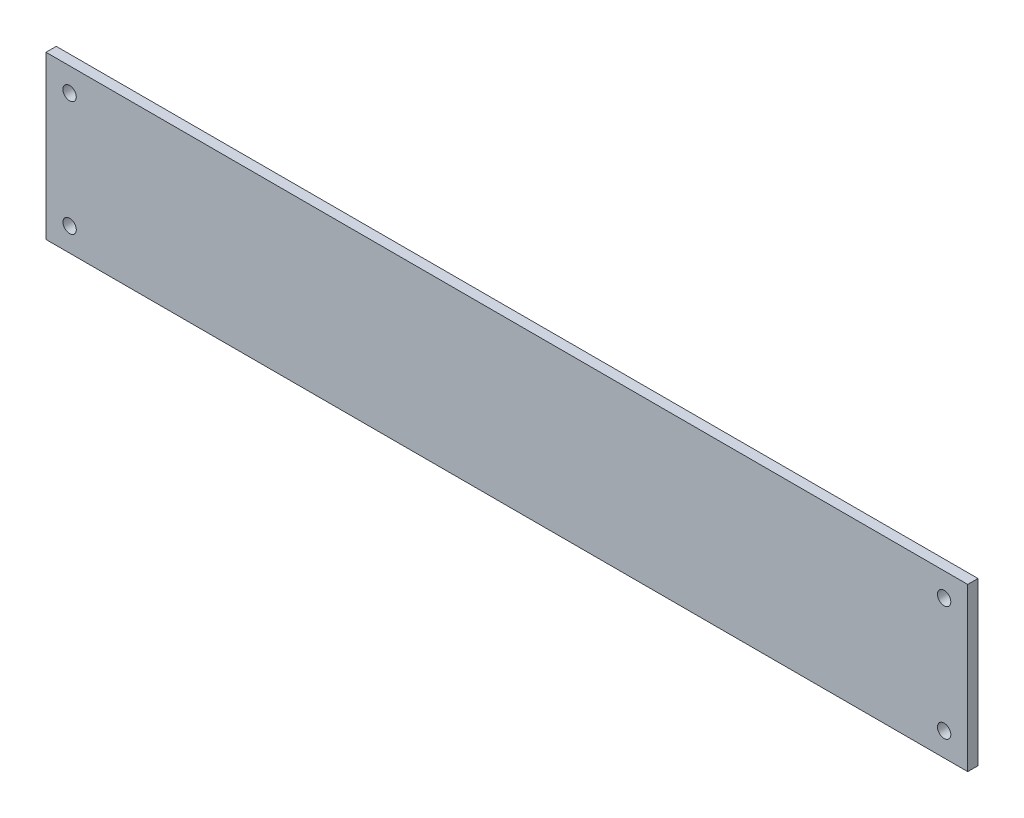
ISO-10303-21;
HEADER;
FILE_DESCRIPTION(('STEP AP214'),'2;1');
FILE_NAME('part.step','',(''),(''),'','','');
FILE_SCHEMA(('AUTOMOTIVE_DESIGN { 1 0 10303 214 1 1 1 1 }'));
ENDSEC;
DATA;
#1=APPLICATION_CONTEXT('core data for automotive mechanical design processes');
#2=APPLICATION_PROTOCOL_DEFINITION('international standard','automotive_design',2000,#1);
#3=PRODUCT_CONTEXT('',#1,'mechanical');
#4=PRODUCT('Part','Part','',(#3));
#5=PRODUCT_RELATED_PRODUCT_CATEGORY('part','',(#4));
#6=PRODUCT_DEFINITION_FORMATION('','',#4);
#7=PRODUCT_DEFINITION_CONTEXT('part definition',#1,'design');
#8=PRODUCT_DEFINITION('design','',#6,#7);
#9=PRODUCT_DEFINITION_SHAPE('','',#8);
#10=(LENGTH_UNIT() NAMED_UNIT(*) SI_UNIT(.MILLI.,.METRE.));
#11=(NAMED_UNIT(*) PLANE_ANGLE_UNIT() SI_UNIT($,.RADIAN.));
#12=(NAMED_UNIT(*) SI_UNIT($,.STERADIAN.) SOLID_ANGLE_UNIT());
#13=UNCERTAINTY_MEASURE_WITH_UNIT(LENGTH_MEASURE(1.E-05),#10,'distance_accuracy_value','');
#14=(GEOMETRIC_REPRESENTATION_CONTEXT(3) GLOBAL_UNCERTAINTY_ASSIGNED_CONTEXT((#13)) GLOBAL_UNIT_ASSIGNED_CONTEXT((#10,
#11,#12)) REPRESENTATION_CONTEXT('',''));
#15=CARTESIAN_POINT('',(0.,0.,0.));
#16=DIRECTION('',(0.,0.,1.));
#17=DIRECTION('',(1.,0.,0.));
#18=AXIS2_PLACEMENT_3D('',#15,#16,#17);
#19=CARTESIAN_POINT('',(0.,0.,5.));
#20=DIRECTION('',(0.,0.,-1.));
#21=DIRECTION('',(-1.,0.,0.));
#22=AXIS2_PLACEMENT_3D('',#19,#20,#21);
#23=PLANE('',#22);
#24=DIRECTION('',(1.,0.,0.));
#25=VECTOR('',#24,1.);
#26=CARTESIAN_POINT('',(449.,0.,5.));
#27=LINE('',#26,#25);
#28=CARTESIAN_POINT('',(0.,0.,5.));
#29=VERTEX_POINT('',#28);
#30=CARTESIAN_POINT('',(449.,0.,5.));
#31=VERTEX_POINT('',#30);
#32=EDGE_CURVE('E95',#29,#31,#27,.T.);
#33=ORIENTED_EDGE('',*,*,#32,.T.);
#34=DIRECTION('',(0.,1.,0.));
#35=VECTOR('',#34,1.);
#36=CARTESIAN_POINT('',(449.,79.,5.));
#37=LINE('',#36,#35);
#38=CARTESIAN_POINT('',(449.,79.,5.));
#39=VERTEX_POINT('',#38);
#40=EDGE_CURVE('E90',#31,#39,#37,.T.);
#41=ORIENTED_EDGE('',*,*,#40,.T.);
#42=DIRECTION('',(-1.,0.,0.));
#43=VECTOR('',#42,1.);
#44=CARTESIAN_POINT('',(0.,79.,5.));
#45=LINE('',#44,#43);
#46=CARTESIAN_POINT('',(0.,79.,5.));
#47=VERTEX_POINT('',#46);
#48=EDGE_CURVE('E93',#39,#47,#45,.T.);
#49=ORIENTED_EDGE('',*,*,#48,.T.);
#50=DIRECTION('',(0.,-1.,0.));
#51=VECTOR('',#50,1.);
#52=CARTESIAN_POINT('',(0.,0.,5.));
#53=LINE('',#52,#51);
#54=EDGE_CURVE('E58',#47,#29,#53,.T.);
#55=ORIENTED_EDGE('',*,*,#54,.T.);
#56=EDGE_LOOP('',(#33,#41,#49,#55));
#57=FACE_BOUND('',#56,.T.);
#58=CARTESIAN_POINT('',(11.5,67.5,5.));
#59=DIRECTION('',(0.,0.,1.));
#60=DIRECTION('',(1.,0.,0.));
#61=AXIS2_PLACEMENT_3D('',#58,#59,#60);
#62=CIRCLE('',#61,3.25);
#63=CARTESIAN_POINT('',(14.75,67.5,5.));
#64=VERTEX_POINT('',#63);
#65=EDGE_CURVE('E110',#64,#64,#62,.T.);
#66=ORIENTED_EDGE('',*,*,#65,.F.);
#67=EDGE_LOOP('',(#66));
#68=FACE_BOUND('',#67,.T.);
#69=CARTESIAN_POINT('',(437.5,67.5,5.));
#70=DIRECTION('',(0.,0.,1.));
#71=DIRECTION('',(-1.,0.,0.));
#72=AXIS2_PLACEMENT_3D('',#69,#70,#71);
#73=CIRCLE('',#72,3.24999999999995);
#74=CARTESIAN_POINT('',(434.25,67.5,5.));
#75=VERTEX_POINT('',#74);
#76=EDGE_CURVE('E126',#75,#75,#73,.T.);
#77=ORIENTED_EDGE('',*,*,#76,.F.);
#78=EDGE_LOOP('',(#77));
#79=FACE_BOUND('',#78,.T.);
#80=CARTESIAN_POINT('',(11.5,11.5,5.));
#81=DIRECTION('',(0.,0.,1.));
#82=DIRECTION('',(-1.,0.,0.));
#83=AXIS2_PLACEMENT_3D('',#80,#81,#82);
#84=CIRCLE('',#83,3.25);
#85=CARTESIAN_POINT('',(8.25,11.5,5.));
#86=VERTEX_POINT('',#85);
#87=EDGE_CURVE('E133',#86,#86,#84,.T.);
#88=ORIENTED_EDGE('',*,*,#87,.F.);
#89=EDGE_LOOP('',(#88));
#90=FACE_BOUND('',#89,.T.);
#91=CARTESIAN_POINT('',(437.5,11.5,5.));
#92=DIRECTION('',(0.,0.,1.));
#93=DIRECTION('',(1.,0.,0.));
#94=AXIS2_PLACEMENT_3D('',#91,#92,#93);
#95=CIRCLE('',#94,3.24999999999995);
#96=CARTESIAN_POINT('',(440.75,11.5,5.));
#97=VERTEX_POINT('',#96);
#98=EDGE_CURVE('E140',#97,#97,#95,.T.);
#99=ORIENTED_EDGE('',*,*,#98,.F.);
#100=EDGE_LOOP('',(#99));
#101=FACE_BOUND('',#100,.T.);
#102=ADVANCED_FACE('F41',(#57,#68,#79,#90,#101),#23,.F.);
#103=CARTESIAN_POINT('',(0.,0.,0.));
#104=DIRECTION('',(0.,0.,-1.));
#105=DIRECTION('',(-1.,0.,0.));
#106=AXIS2_PLACEMENT_3D('',#103,#104,#105);
#107=PLANE('',#106);
#108=CARTESIAN_POINT('',(11.5,11.5,0.));
#109=DIRECTION('',(0.,0.,1.));
#110=DIRECTION('',(-1.,0.,0.));
#111=AXIS2_PLACEMENT_3D('',#108,#109,#110);
#112=CIRCLE('',#111,3.25);
#113=CARTESIAN_POINT('',(8.25,11.5,0.));
#114=VERTEX_POINT('',#113);
#115=EDGE_CURVE('E136',#114,#114,#112,.T.);
#116=ORIENTED_EDGE('',*,*,#115,.T.);
#117=EDGE_LOOP('',(#116));
#118=FACE_BOUND('',#117,.T.);
#119=CARTESIAN_POINT('',(11.5,67.5,0.));
#120=DIRECTION('',(0.,0.,1.));
#121=DIRECTION('',(1.,0.,0.));
#122=AXIS2_PLACEMENT_3D('',#119,#120,#121);
#123=CIRCLE('',#122,3.25);
#124=CARTESIAN_POINT('',(14.75,67.5,0.));
#125=VERTEX_POINT('',#124);
#126=EDGE_CURVE('E122',#125,#125,#123,.T.);
#127=ORIENTED_EDGE('',*,*,#126,.T.);
#128=EDGE_LOOP('',(#127));
#129=FACE_BOUND('',#128,.T.);
#130=DIRECTION('',(1.,0.,0.));
#131=VECTOR('',#130,1.);
#132=CARTESIAN_POINT('',(449.,0.,0.));
#133=LINE('',#132,#131);
#134=CARTESIAN_POINT('',(0.,0.,0.));
#135=VERTEX_POINT('',#134);
#136=CARTESIAN_POINT('',(449.,0.,0.));
#137=VERTEX_POINT('',#136);
#138=EDGE_CURVE('E107',#135,#137,#133,.T.);
#139=ORIENTED_EDGE('',*,*,#138,.F.);
#140=DIRECTION('',(0.,-1.,0.));
#141=VECTOR('',#140,1.);
#142=CARTESIAN_POINT('',(0.,0.,0.));
#143=LINE('',#142,#141);
#144=CARTESIAN_POINT('',(0.,79.,0.));
#145=VERTEX_POINT('',#144);
#146=EDGE_CURVE('E83',#145,#135,#143,.T.);
#147=ORIENTED_EDGE('',*,*,#146,.F.);
#148=DIRECTION('',(-1.,0.,0.));
#149=VECTOR('',#148,1.);
#150=CARTESIAN_POINT('',(0.,79.,0.));
#151=LINE('',#150,#149);
#152=CARTESIAN_POINT('',(449.,79.,0.));
#153=VERTEX_POINT('',#152);
#154=EDGE_CURVE('E77',#153,#145,#151,.T.);
#155=ORIENTED_EDGE('',*,*,#154,.F.);
#156=DIRECTION('',(0.,1.,0.));
#157=VECTOR('',#156,1.);
#158=CARTESIAN_POINT('',(449.,79.,0.));
#159=LINE('',#158,#157);
#160=EDGE_CURVE('E99',#137,#153,#159,.T.);
#161=ORIENTED_EDGE('',*,*,#160,.F.);
#162=EDGE_LOOP('',(#139,#147,#155,#161));
#163=FACE_BOUND('',#162,.T.);
#164=CARTESIAN_POINT('',(437.5,67.5,0.));
#165=DIRECTION('',(0.,0.,1.));
#166=DIRECTION('',(-1.,0.,0.));
#167=AXIS2_PLACEMENT_3D('',#164,#165,#166);
#168=CIRCLE('',#167,3.24999999999995);
#169=CARTESIAN_POINT('',(434.25,67.5,0.));
#170=VERTEX_POINT('',#169);
#171=EDGE_CURVE('E129',#170,#170,#168,.T.);
#172=ORIENTED_EDGE('',*,*,#171,.T.);
#173=EDGE_LOOP('',(#172));
#174=FACE_BOUND('',#173,.T.);
#175=CARTESIAN_POINT('',(437.5,11.5,0.));
#176=DIRECTION('',(0.,0.,1.));
#177=DIRECTION('',(1.,0.,0.));
#178=AXIS2_PLACEMENT_3D('',#175,#176,#177);
#179=CIRCLE('',#178,3.24999999999995);
#180=CARTESIAN_POINT('',(440.75,11.5,0.));
#181=VERTEX_POINT('',#180);
#182=EDGE_CURVE('E143',#181,#181,#179,.T.);
#183=ORIENTED_EDGE('',*,*,#182,.T.);
#184=EDGE_LOOP('',(#183));
#185=FACE_BOUND('',#184,.T.);
#186=ADVANCED_FACE('F118',(#118,#129,#163,#174,#185),#107,.T.);
#187=CARTESIAN_POINT('',(449.,0.,5.));
#188=DIRECTION('',(0.,1.,0.));
#189=DIRECTION('',(-1.,0.,0.));
#190=AXIS2_PLACEMENT_3D('',#187,#188,#189);
#191=PLANE('',#190);
#192=ORIENTED_EDGE('',*,*,#138,.T.);
#193=DIRECTION('',(0.,0.,-1.));
#194=VECTOR('',#193,1.);
#195=CARTESIAN_POINT('',(449.,0.,5.));
#196=LINE('',#195,#194);
#197=EDGE_CURVE('E11',#31,#137,#196,.T.);
#198=ORIENTED_EDGE('',*,*,#197,.F.);
#199=ORIENTED_EDGE('',*,*,#32,.F.);
#200=DIRECTION('',(0.,0.,-1.));
#201=VECTOR('',#200,1.);
#202=CARTESIAN_POINT('',(0.,0.,5.));
#203=LINE('',#202,#201);
#204=EDGE_CURVE('E103',#29,#135,#203,.T.);
#205=ORIENTED_EDGE('',*,*,#204,.T.);
#206=EDGE_LOOP('',(#192,#198,#199,#205));
#207=FACE_BOUND('',#206,.T.);
#208=ADVANCED_FACE('F43',(#207),#191,.F.);
#209=CARTESIAN_POINT('',(449.,79.,5.));
#210=DIRECTION('',(-1.,0.,0.));
#211=DIRECTION('',(0.,0.,1.));
#212=AXIS2_PLACEMENT_3D('',#209,#210,#211);
#213=PLANE('',#212);
#214=ORIENTED_EDGE('',*,*,#160,.T.);
#215=DIRECTION('',(0.,0.,-1.));
#216=VECTOR('',#215,1.);
#217=CARTESIAN_POINT('',(449.,79.,5.));
#218=LINE('',#217,#216);
#219=EDGE_CURVE('E50',#39,#153,#218,.T.);
#220=ORIENTED_EDGE('',*,*,#219,.F.);
#221=ORIENTED_EDGE('',*,*,#40,.F.);
#222=ORIENTED_EDGE('',*,*,#197,.T.);
#223=EDGE_LOOP('',(#214,#220,#221,#222));
#224=FACE_BOUND('',#223,.T.);
#225=ADVANCED_FACE('F98',(#224),#213,.F.);
#226=CARTESIAN_POINT('',(0.,79.,5.));
#227=DIRECTION('',(0.,-1.,0.));
#228=DIRECTION('',(0.,0.,-1.));
#229=AXIS2_PLACEMENT_3D('',#226,#227,#228);
#230=PLANE('',#229);
#231=ORIENTED_EDGE('',*,*,#154,.T.);
#232=DIRECTION('',(0.,0.,-1.));
#233=VECTOR('',#232,1.);
#234=CARTESIAN_POINT('',(0.,79.,5.));
#235=LINE('',#234,#233);
#236=EDGE_CURVE('E100',#47,#145,#235,.T.);
#237=ORIENTED_EDGE('',*,*,#236,.F.);
#238=ORIENTED_EDGE('',*,*,#48,.F.);
#239=ORIENTED_EDGE('',*,*,#219,.T.);
#240=EDGE_LOOP('',(#231,#237,#238,#239));
#241=FACE_BOUND('',#240,.T.);
#242=ADVANCED_FACE('F101',(#241),#230,.F.);
#243=CARTESIAN_POINT('',(0.,0.,5.));
#244=DIRECTION('',(1.,0.,0.));
#245=DIRECTION('',(0.,1.,0.));
#246=AXIS2_PLACEMENT_3D('',#243,#244,#245);
#247=PLANE('',#246);
#248=ORIENTED_EDGE('',*,*,#146,.T.);
#249=ORIENTED_EDGE('',*,*,#204,.F.);
#250=ORIENTED_EDGE('',*,*,#54,.F.);
#251=ORIENTED_EDGE('',*,*,#236,.T.);
#252=EDGE_LOOP('',(#248,#249,#250,#251));
#253=FACE_BOUND('',#252,.T.);
#254=ADVANCED_FACE('F115',(#253),#247,.F.);
#255=CARTESIAN_POINT('',(11.5,67.5,5.));
#256=DIRECTION('',(0.,0.,-1.));
#257=DIRECTION('',(-1.,0.,0.));
#258=AXIS2_PLACEMENT_3D('',#255,#256,#257);
#259=CYLINDRICAL_SURFACE('',#258,3.25);
#260=ORIENTED_EDGE('',*,*,#65,.T.);
#261=EDGE_LOOP('',(#260));
#262=FACE_BOUND('',#261,.T.);
#263=ORIENTED_EDGE('',*,*,#126,.F.);
#264=EDGE_LOOP('',(#263));
#265=FACE_BOUND('',#264,.T.);
#266=ADVANCED_FACE('F161',(#262,#265),#259,.F.);
#267=CARTESIAN_POINT('',(437.5,67.5,5.));
#268=DIRECTION('',(0.,0.,-1.));
#269=DIRECTION('',(-1.,0.,0.));
#270=AXIS2_PLACEMENT_3D('',#267,#268,#269);
#271=CYLINDRICAL_SURFACE('',#270,3.24999999999995);
#272=ORIENTED_EDGE('',*,*,#76,.T.);
#273=EDGE_LOOP('',(#272));
#274=FACE_BOUND('',#273,.T.);
#275=ORIENTED_EDGE('',*,*,#171,.F.);
#276=EDGE_LOOP('',(#275));
#277=FACE_BOUND('',#276,.T.);
#278=ADVANCED_FACE('F210',(#274,#277),#271,.F.);
#279=CARTESIAN_POINT('',(11.5,11.5,5.));
#280=DIRECTION('',(0.,0.,-1.));
#281=DIRECTION('',(-1.,0.,0.));
#282=AXIS2_PLACEMENT_3D('',#279,#280,#281);
#283=CYLINDRICAL_SURFACE('',#282,3.25);
#284=ORIENTED_EDGE('',*,*,#87,.T.);
#285=EDGE_LOOP('',(#284));
#286=FACE_BOUND('',#285,.T.);
#287=ORIENTED_EDGE('',*,*,#115,.F.);
#288=EDGE_LOOP('',(#287));
#289=FACE_BOUND('',#288,.T.);
#290=ADVANCED_FACE('F218',(#286,#289),#283,.F.);
#291=CARTESIAN_POINT('',(437.5,11.5,5.));
#292=DIRECTION('',(0.,0.,-1.));
#293=DIRECTION('',(-1.,0.,0.));
#294=AXIS2_PLACEMENT_3D('',#291,#292,#293);
#295=CYLINDRICAL_SURFACE('',#294,3.24999999999995);
#296=ORIENTED_EDGE('',*,*,#98,.T.);
#297=EDGE_LOOP('',(#296));
#298=FACE_BOUND('',#297,.T.);
#299=ORIENTED_EDGE('',*,*,#182,.F.);
#300=EDGE_LOOP('',(#299));
#301=FACE_BOUND('',#300,.T.);
#302=ADVANCED_FACE('F150',(#298,#301),#295,.F.);
#303=CLOSED_SHELL('',(#102,#186,#208,#225,#242,#254,#266,#278,#290,#302));
#304=MANIFOLD_SOLID_BREP('B2',#303);
#305=ADVANCED_BREP_SHAPE_REPRESENTATION('',(#18,#304),#14);
#306=SHAPE_DEFINITION_REPRESENTATION(#9,#305);
ENDSEC;
END-ISO-10303-21;
